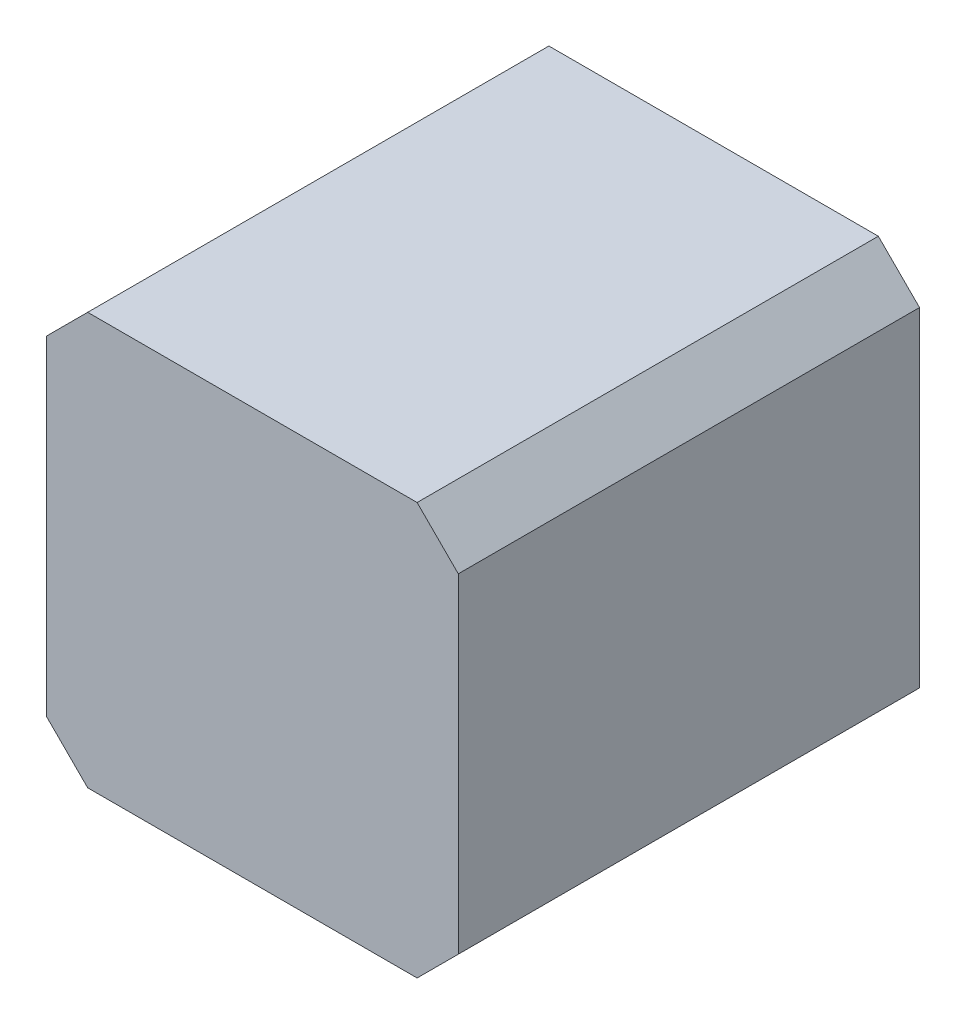
ISO-10303-21;
HEADER;
FILE_DESCRIPTION(('STEP AP214'),'2;1');
FILE_NAME('part.step','',(''),(''),'','','');
FILE_SCHEMA(('AUTOMOTIVE_DESIGN { 1 0 10303 214 1 1 1 1 }'));
ENDSEC;
DATA;
#1=APPLICATION_CONTEXT('core data for automotive mechanical design processes');
#2=APPLICATION_PROTOCOL_DEFINITION('international standard','automotive_design',2000,#1);
#3=PRODUCT_CONTEXT('',#1,'mechanical');
#4=PRODUCT('Part','Part','',(#3));
#5=PRODUCT_RELATED_PRODUCT_CATEGORY('part','',(#4));
#6=PRODUCT_DEFINITION_FORMATION('','',#4);
#7=PRODUCT_DEFINITION_CONTEXT('part definition',#1,'design');
#8=PRODUCT_DEFINITION('design','',#6,#7);
#9=PRODUCT_DEFINITION_SHAPE('','',#8);
#10=(LENGTH_UNIT() NAMED_UNIT(*) SI_UNIT(.MILLI.,.METRE.));
#11=(NAMED_UNIT(*) PLANE_ANGLE_UNIT() SI_UNIT($,.RADIAN.));
#12=(NAMED_UNIT(*) SI_UNIT($,.STERADIAN.) SOLID_ANGLE_UNIT());
#13=UNCERTAINTY_MEASURE_WITH_UNIT(LENGTH_MEASURE(1.E-05),#10,'distance_accuracy_value','');
#14=(GEOMETRIC_REPRESENTATION_CONTEXT(3) GLOBAL_UNCERTAINTY_ASSIGNED_CONTEXT((#13)) GLOBAL_UNIT_ASSIGNED_CONTEXT((#10,
#11,#12)) REPRESENTATION_CONTEXT('',''));
#15=CARTESIAN_POINT('',(0.,0.,0.));
#16=DIRECTION('',(0.,0.,1.));
#17=DIRECTION('',(1.,0.,0.));
#18=AXIS2_PLACEMENT_3D('',#15,#16,#17);
#19=CARTESIAN_POINT('',(-1.25000004,0.99998276,0.));
#20=DIRECTION('',(-0.707106781186548,0.707106781186548,0.));
#21=DIRECTION('',(-0.707106781186548,-0.707106781186548,0.));
#22=AXIS2_PLACEMENT_3D('',#19,#20,#21);
#23=PLANE('',#22);
#24=DIRECTION('',(0.,0.,1.));
#25=VECTOR('',#24,1.);
#26=CARTESIAN_POINT('',(-1.00000054,1.24998226,0.));
#27=LINE('',#26,#25);
#28=CARTESIAN_POINT('',(-1.00000054,1.24998226,0.));
#29=VERTEX_POINT('',#28);
#30=CARTESIAN_POINT('',(-1.00000054,1.24998226,2.79999948));
#31=VERTEX_POINT('',#30);
#32=EDGE_CURVE('E91',#29,#31,#27,.T.);
#33=ORIENTED_EDGE('',*,*,#32,.F.);
#34=DIRECTION('',(-0.707106781186548,-0.707106781186548,0.));
#35=VECTOR('',#34,1.);
#36=CARTESIAN_POINT('',(-1.25000004,0.99998276,0.));
#37=LINE('',#36,#35);
#38=CARTESIAN_POINT('',(-1.25000004,0.99998276,0.));
#39=VERTEX_POINT('',#38);
#40=EDGE_CURVE('E50',#29,#39,#37,.T.);
#41=ORIENTED_EDGE('',*,*,#40,.T.);
#42=DIRECTION('',(0.,0.,1.));
#43=VECTOR('',#42,1.);
#44=CARTESIAN_POINT('',(-1.25000004,0.99998276,0.));
#45=LINE('',#44,#43);
#46=CARTESIAN_POINT('',(-1.25000004,0.99998276,2.79999948));
#47=VERTEX_POINT('',#46);
#48=EDGE_CURVE('E100',#47,#39,#45,.F.);
#49=ORIENTED_EDGE('',*,*,#48,.F.);
#50=DIRECTION('',(-0.707106781186547,-0.707106781186548,0.));
#51=VECTOR('',#50,1.);
#52=CARTESIAN_POINT('',(-1.00000054,1.24998226,2.79999948));
#53=LINE('',#52,#51);
#54=EDGE_CURVE('E99',#31,#47,#53,.T.);
#55=ORIENTED_EDGE('',*,*,#54,.F.);
#56=EDGE_LOOP('',(#33,#41,#49,#55));
#57=FACE_BOUND('',#56,.T.);
#58=ADVANCED_FACE('F17',(#57),#23,.T.);
#59=CARTESIAN_POINT('',(-1.00000054,-1.25001782,0.));
#60=DIRECTION('',(-0.707106781186548,-0.707106781186548,0.));
#61=DIRECTION('',(0.707106781186548,-0.707106781186548,0.));
#62=AXIS2_PLACEMENT_3D('',#59,#60,#61);
#63=PLANE('',#62);
#64=DIRECTION('',(0.,0.,1.));
#65=VECTOR('',#64,1.);
#66=CARTESIAN_POINT('',(-1.25000004,-1.00001832,0.));
#67=LINE('',#66,#65);
#68=CARTESIAN_POINT('',(-1.25000004,-1.00001832,0.));
#69=VERTEX_POINT('',#68);
#70=CARTESIAN_POINT('',(-1.25000004,-1.00001832,2.79999948));
#71=VERTEX_POINT('',#70);
#72=EDGE_CURVE('E111',#69,#71,#67,.T.);
#73=ORIENTED_EDGE('',*,*,#72,.F.);
#74=DIRECTION('',(0.707106781186548,-0.707106781186548,0.));
#75=VECTOR('',#74,1.);
#76=CARTESIAN_POINT('',(-1.00000054,-1.25001782,0.));
#77=LINE('',#76,#75);
#78=CARTESIAN_POINT('',(-1.00000054,-1.25001782,0.));
#79=VERTEX_POINT('',#78);
#80=EDGE_CURVE('E114',#69,#79,#77,.T.);
#81=ORIENTED_EDGE('',*,*,#80,.T.);
#82=DIRECTION('',(0.,0.,-1.));
#83=VECTOR('',#82,1.);
#84=CARTESIAN_POINT('',(-1.00000054,-1.25001782,0.));
#85=LINE('',#84,#83);
#86=CARTESIAN_POINT('',(-1.00000054,-1.25001782,2.79999948));
#87=VERTEX_POINT('',#86);
#88=EDGE_CURVE('E128',#87,#79,#85,.T.);
#89=ORIENTED_EDGE('',*,*,#88,.F.);
#90=DIRECTION('',(0.707106781186547,-0.707106781186548,0.));
#91=VECTOR('',#90,1.);
#92=CARTESIAN_POINT('',(-1.25000004,-1.00001832,2.79999948));
#93=LINE('',#92,#91);
#94=EDGE_CURVE('E104',#71,#87,#93,.T.);
#95=ORIENTED_EDGE('',*,*,#94,.F.);
#96=EDGE_LOOP('',(#73,#81,#89,#95));
#97=FACE_BOUND('',#96,.T.);
#98=ADVANCED_FACE('F182',(#97),#63,.T.);
#99=CARTESIAN_POINT('',(1.00019104,1.24984256,0.));
#100=DIRECTION('',(0.707178667200132,0.707034887864132,0.));
#101=DIRECTION('',(-0.707034887864132,0.707178667200132,0.));
#102=AXIS2_PLACEMENT_3D('',#99,#100,#101);
#103=PLANE('',#102);
#104=DIRECTION('',(0.,0.,-1.));
#105=VECTOR('',#104,1.);
#106=CARTESIAN_POINT('',(1.25000004,0.99998276,0.));
#107=LINE('',#106,#105);
#108=CARTESIAN_POINT('',(1.25000004000006,0.999982760000055,0.));
#109=VERTEX_POINT('',#108);
#110=CARTESIAN_POINT('',(1.25000004,0.99998276,2.79999948));
#111=VERTEX_POINT('',#110);
#112=EDGE_CURVE('E126',#109,#111,#107,.F.);
#113=ORIENTED_EDGE('',*,*,#112,.F.);
#114=DIRECTION('',(-0.707034887864132,0.707178667200132,0.));
#115=VECTOR('',#114,1.);
#116=CARTESIAN_POINT('',(1.00019104,1.24984256,0.));
#117=LINE('',#116,#115);
#118=CARTESIAN_POINT('',(0.999998,1.24993146,0.));
#119=VERTEX_POINT('',#118);
#120=EDGE_CURVE('E35',#109,#119,#117,.T.);
#121=ORIENTED_EDGE('',*,*,#120,.T.);
#122=DIRECTION('',(0.,0.,-1.));
#123=VECTOR('',#122,1.);
#124=CARTESIAN_POINT('',(1.00001327218131,1.25002036396873,0.));
#125=LINE('',#124,#123);
#126=CARTESIAN_POINT('',(0.999998,1.24993146,2.79999948));
#127=VERTEX_POINT('',#126);
#128=EDGE_CURVE('E109',#127,#119,#125,.T.);
#129=ORIENTED_EDGE('',*,*,#128,.F.);
#130=DIRECTION('',(-0.707034887863818,0.707178667200445,0.));
#131=VECTOR('',#130,1.);
#132=CARTESIAN_POINT('',(1.25000004,0.99998276,2.79999948));
#133=LINE('',#132,#131);
#134=EDGE_CURVE('E108',#111,#127,#133,.T.);
#135=ORIENTED_EDGE('',*,*,#134,.F.);
#136=EDGE_LOOP('',(#113,#121,#129,#135));
#137=FACE_BOUND('',#136,.T.);
#138=ADVANCED_FACE('F190',(#137),#103,.T.);
#139=CARTESIAN_POINT('',(1.00019104,1.24984256,2.79999948));
#140=DIRECTION('',(0.,0.,1.));
#141=DIRECTION('',(1.,0.,0.));
#142=AXIS2_PLACEMENT_3D('',#139,#140,#141);
#143=PLANE('',#142);
#144=DIRECTION('',(0.,1.,0.));
#145=VECTOR('',#144,1.);
#146=CARTESIAN_POINT('',(1.25000004,0.99998276,2.79999948));
#147=LINE('',#146,#145);
#148=CARTESIAN_POINT('',(1.25000004,-1.00001832,2.79999948));
#149=VERTEX_POINT('',#148);
#150=EDGE_CURVE('E67',#111,#149,#147,.F.);
#151=ORIENTED_EDGE('',*,*,#150,.F.);
#152=ORIENTED_EDGE('',*,*,#134,.T.);
#153=DIRECTION('',(-0.999999999818514,-1.90518527880107E-05,0.));
#154=VECTOR('',#153,1.);
#155=CARTESIAN_POINT('',(-1.00000054,1.24998226,2.79999948));
#156=LINE('',#155,#154);
#157=EDGE_CURVE('E95',#31,#127,#156,.F.);
#158=ORIENTED_EDGE('',*,*,#157,.F.);
#159=ORIENTED_EDGE('',*,*,#54,.T.);
#160=DIRECTION('',(0.,1.,0.));
#161=VECTOR('',#160,1.);
#162=CARTESIAN_POINT('',(-1.25000004,-1.00001832,2.79999948));
#163=LINE('',#162,#161);
#164=EDGE_CURVE('E135',#71,#47,#163,.T.);
#165=ORIENTED_EDGE('',*,*,#164,.F.);
#166=ORIENTED_EDGE('',*,*,#94,.T.);
#167=DIRECTION('',(1.,0.,0.));
#168=VECTOR('',#167,1.);
#169=CARTESIAN_POINT('',(1.00000054,-1.25001782,2.79999948));
#170=LINE('',#169,#168);
#171=CARTESIAN_POINT('',(1.00000054,-1.25001782,2.79999948));
#172=VERTEX_POINT('',#171);
#173=EDGE_CURVE('E159',#172,#87,#170,.F.);
#174=ORIENTED_EDGE('',*,*,#173,.F.);
#175=DIRECTION('',(0.707106781186548,0.707106781186548,0.));
#176=VECTOR('',#175,1.);
#177=CARTESIAN_POINT('',(1.25000004,-1.00001832,2.79999948));
#178=LINE('',#177,#176);
#179=EDGE_CURVE('E168',#149,#172,#178,.F.);
#180=ORIENTED_EDGE('',*,*,#179,.F.);
#181=EDGE_LOOP('',(#151,#152,#158,#159,#165,#166,#174,#180));
#182=FACE_BOUND('',#181,.T.);
#183=ADVANCED_FACE('F106',(#182),#143,.T.);
#184=CARTESIAN_POINT('',(1.25000004,-1.00001832,0.));
#185=DIRECTION('',(0.707106781186548,-0.707106781186548,0.));
#186=DIRECTION('',(0.707106781186548,0.707106781186548,0.));
#187=AXIS2_PLACEMENT_3D('',#184,#185,#186);
#188=PLANE('',#187);
#189=DIRECTION('',(0.,0.,-1.));
#190=VECTOR('',#189,1.);
#191=CARTESIAN_POINT('',(1.00000054,-1.25001782,0.));
#192=LINE('',#191,#190);
#193=CARTESIAN_POINT('',(1.00000054,-1.25001782,0.));
#194=VERTEX_POINT('',#193);
#195=EDGE_CURVE('E140',#194,#172,#192,.F.);
#196=ORIENTED_EDGE('',*,*,#195,.F.);
#197=DIRECTION('',(0.707106781186548,0.707106781186548,0.));
#198=VECTOR('',#197,1.);
#199=CARTESIAN_POINT('',(1.25000004,-1.00001832,0.));
#200=LINE('',#199,#198);
#201=CARTESIAN_POINT('',(1.25000004,-1.00001832,0.));
#202=VERTEX_POINT('',#201);
#203=EDGE_CURVE('E97',#194,#202,#200,.T.);
#204=ORIENTED_EDGE('',*,*,#203,.T.);
#205=DIRECTION('',(0.,0.,-1.));
#206=VECTOR('',#205,1.);
#207=CARTESIAN_POINT('',(1.25000004,-1.00001832,0.));
#208=LINE('',#207,#206);
#209=EDGE_CURVE('E132',#149,#202,#208,.T.);
#210=ORIENTED_EDGE('',*,*,#209,.F.);
#211=ORIENTED_EDGE('',*,*,#179,.T.);
#212=EDGE_LOOP('',(#196,#204,#210,#211));
#213=FACE_BOUND('',#212,.T.);
#214=ADVANCED_FACE('F188',(#213),#188,.T.);
#215=CARTESIAN_POINT('',(-1.00000054,1.24998226,0.));
#216=DIRECTION('',(-1.90518527880107E-05,0.999999999818514,0.));
#217=DIRECTION('',(-0.999999999818514,-1.90518527880107E-05,0.));
#218=AXIS2_PLACEMENT_3D('',#215,#216,#217);
#219=PLANE('',#218);
#220=ORIENTED_EDGE('',*,*,#128,.T.);
#221=DIRECTION('',(-0.999999999818513,-1.90518527892174E-05,0.));
#222=VECTOR('',#221,1.);
#223=CARTESIAN_POINT('',(0.99980496,1.25002036,0.));
#224=LINE('',#223,#222);
#225=EDGE_CURVE('E96',#119,#29,#224,.T.);
#226=ORIENTED_EDGE('',*,*,#225,.T.);
#227=ORIENTED_EDGE('',*,*,#32,.T.);
#228=ORIENTED_EDGE('',*,*,#157,.T.);
#229=EDGE_LOOP('',(#220,#226,#227,#228));
#230=FACE_BOUND('',#229,.T.);
#231=ADVANCED_FACE('F93',(#230),#219,.T.);
#232=CARTESIAN_POINT('',(-1.25000004,-1.00001832,0.));
#233=DIRECTION('',(-1.,0.,0.));
#234=DIRECTION('',(0.,0.,1.));
#235=AXIS2_PLACEMENT_3D('',#232,#233,#234);
#236=PLANE('',#235);
#237=ORIENTED_EDGE('',*,*,#48,.T.);
#238=DIRECTION('',(0.,1.,0.));
#239=VECTOR('',#238,1.);
#240=CARTESIAN_POINT('',(-1.25000004,1.24984256,0.));
#241=LINE('',#240,#239);
#242=EDGE_CURVE('E145',#39,#69,#241,.F.);
#243=ORIENTED_EDGE('',*,*,#242,.T.);
#244=ORIENTED_EDGE('',*,*,#72,.T.);
#245=ORIENTED_EDGE('',*,*,#164,.T.);
#246=EDGE_LOOP('',(#237,#243,#244,#245));
#247=FACE_BOUND('',#246,.T.);
#248=ADVANCED_FACE('F208',(#247),#236,.T.);
#249=CARTESIAN_POINT('',(1.00000054,-1.25001782,0.));
#250=DIRECTION('',(0.,-1.,0.));
#251=DIRECTION('',(0.,0.,-1.));
#252=AXIS2_PLACEMENT_3D('',#249,#250,#251);
#253=PLANE('',#252);
#254=ORIENTED_EDGE('',*,*,#88,.T.);
#255=DIRECTION('',(1.,0.,0.));
#256=VECTOR('',#255,1.);
#257=CARTESIAN_POINT('',(1.00019104,-1.25001782,0.));
#258=LINE('',#257,#256);
#259=EDGE_CURVE('E26',#79,#194,#258,.T.);
#260=ORIENTED_EDGE('',*,*,#259,.T.);
#261=ORIENTED_EDGE('',*,*,#195,.T.);
#262=ORIENTED_EDGE('',*,*,#173,.T.);
#263=EDGE_LOOP('',(#254,#260,#261,#262));
#264=FACE_BOUND('',#263,.T.);
#265=ADVANCED_FACE('F178',(#264),#253,.T.);
#266=CARTESIAN_POINT('',(1.25000004,0.99998276,0.));
#267=DIRECTION('',(1.,0.,0.));
#268=DIRECTION('',(0.,0.,-1.));
#269=AXIS2_PLACEMENT_3D('',#266,#267,#268);
#270=PLANE('',#269);
#271=ORIENTED_EDGE('',*,*,#209,.T.);
#272=DIRECTION('',(0.,1.,0.));
#273=VECTOR('',#272,1.);
#274=CARTESIAN_POINT('',(1.25000004,1.24984256,0.));
#275=LINE('',#274,#273);
#276=EDGE_CURVE('E11',#202,#109,#275,.T.);
#277=ORIENTED_EDGE('',*,*,#276,.T.);
#278=ORIENTED_EDGE('',*,*,#112,.T.);
#279=ORIENTED_EDGE('',*,*,#150,.T.);
#280=EDGE_LOOP('',(#271,#277,#278,#279));
#281=FACE_BOUND('',#280,.T.);
#282=ADVANCED_FACE('F189',(#281),#270,.T.);
#283=CARTESIAN_POINT('',(1.00019104,1.24984256,0.));
#284=DIRECTION('',(0.,0.,1.));
#285=DIRECTION('',(1.,0.,0.));
#286=AXIS2_PLACEMENT_3D('',#283,#284,#285);
#287=PLANE('',#286);
#288=ORIENTED_EDGE('',*,*,#276,.F.);
#289=ORIENTED_EDGE('',*,*,#203,.F.);
#290=ORIENTED_EDGE('',*,*,#259,.F.);
#291=ORIENTED_EDGE('',*,*,#80,.F.);
#292=ORIENTED_EDGE('',*,*,#242,.F.);
#293=ORIENTED_EDGE('',*,*,#40,.F.);
#294=ORIENTED_EDGE('',*,*,#225,.F.);
#295=ORIENTED_EDGE('',*,*,#120,.F.);
#296=EDGE_LOOP('',(#288,#289,#290,#291,#292,#293,#294,#295));
#297=FACE_BOUND('',#296,.T.);
#298=ADVANCED_FACE('F183',(#297),#287,.F.);
#299=CLOSED_SHELL('',(#58,#98,#138,#183,#214,#231,#248,#265,#282,#298));
#300=MANIFOLD_SOLID_BREP('B1',#299);
#301=ADVANCED_BREP_SHAPE_REPRESENTATION('',(#18,#300),#14);
#302=SHAPE_DEFINITION_REPRESENTATION(#9,#301);
ENDSEC;
END-ISO-10303-21;
